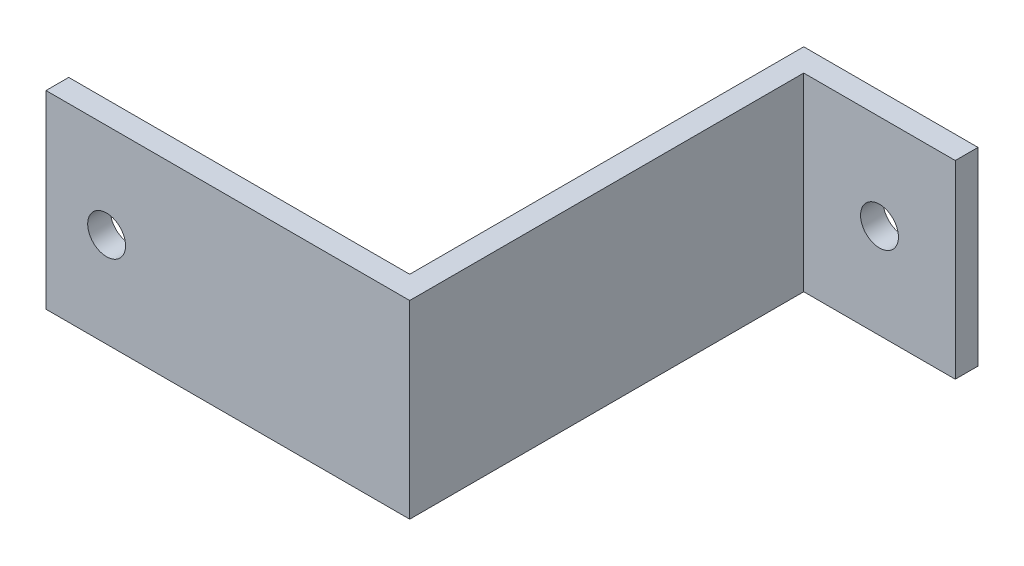
ISO-10303-21;
HEADER;
FILE_DESCRIPTION(('STEP AP214'),'2;1');
FILE_NAME('part.step','',(''),(''),'','','');
FILE_SCHEMA(('AUTOMOTIVE_DESIGN { 1 0 10303 214 1 1 1 1 }'));
ENDSEC;
DATA;
#1=APPLICATION_CONTEXT('core data for automotive mechanical design processes');
#2=APPLICATION_PROTOCOL_DEFINITION('international standard','automotive_design',2000,#1);
#3=PRODUCT_CONTEXT('',#1,'mechanical');
#4=PRODUCT('Part','Part','',(#3));
#5=PRODUCT_RELATED_PRODUCT_CATEGORY('part','',(#4));
#6=PRODUCT_DEFINITION_FORMATION('','',#4);
#7=PRODUCT_DEFINITION_CONTEXT('part definition',#1,'design');
#8=PRODUCT_DEFINITION('design','',#6,#7);
#9=PRODUCT_DEFINITION_SHAPE('','',#8);
#10=(LENGTH_UNIT() NAMED_UNIT(*) SI_UNIT(.MILLI.,.METRE.));
#11=(NAMED_UNIT(*) PLANE_ANGLE_UNIT() SI_UNIT($,.RADIAN.));
#12=(NAMED_UNIT(*) SI_UNIT($,.STERADIAN.) SOLID_ANGLE_UNIT());
#13=UNCERTAINTY_MEASURE_WITH_UNIT(LENGTH_MEASURE(1.E-05),#10,'distance_accuracy_value','');
#14=(GEOMETRIC_REPRESENTATION_CONTEXT(3) GLOBAL_UNCERTAINTY_ASSIGNED_CONTEXT((#13)) GLOBAL_UNIT_ASSIGNED_CONTEXT((#10,
#11,#12)) REPRESENTATION_CONTEXT('',''));
#15=CARTESIAN_POINT('',(0.,0.,0.));
#16=DIRECTION('',(0.,0.,1.));
#17=DIRECTION('',(1.,0.,0.));
#18=AXIS2_PLACEMENT_3D('',#15,#16,#17);
#19=CARTESIAN_POINT('',(-3.,25.,0.));
#20=DIRECTION('',(1.,0.,0.));
#21=DIRECTION('',(0.,0.,-1.));
#22=AXIS2_PLACEMENT_3D('',#19,#20,#21);
#23=PLANE('',#22);
#24=DIRECTION('',(0.,0.,1.));
#25=VECTOR('',#24,1.);
#26=CARTESIAN_POINT('',(-3.,0.,0.));
#27=LINE('',#26,#25);
#28=CARTESIAN_POINT('',(-3.,0.,0.));
#29=VERTEX_POINT('',#28);
#30=CARTESIAN_POINT('',(-2.99999999999999,0.,52.));
#31=VERTEX_POINT('',#30);
#32=EDGE_CURVE('E145',#29,#31,#27,.T.);
#33=ORIENTED_EDGE('',*,*,#32,.T.);
#34=DIRECTION('',(0.,-1.,0.));
#35=VECTOR('',#34,1.);
#36=CARTESIAN_POINT('',(-2.99999999999999,25.,52.));
#37=LINE('',#36,#35);
#38=CARTESIAN_POINT('',(-2.99999999999999,25.,52.));
#39=VERTEX_POINT('',#38);
#40=EDGE_CURVE('E49',#39,#31,#37,.T.);
#41=ORIENTED_EDGE('',*,*,#40,.F.);
#42=DIRECTION('',(0.,0.,1.));
#43=VECTOR('',#42,1.);
#44=CARTESIAN_POINT('',(-3.,25.,0.));
#45=LINE('',#44,#43);
#46=CARTESIAN_POINT('',(-3.,25.,0.));
#47=VERTEX_POINT('',#46);
#48=EDGE_CURVE('E101',#47,#39,#45,.T.);
#49=ORIENTED_EDGE('',*,*,#48,.F.);
#50=DIRECTION('',(0.,-1.,0.));
#51=VECTOR('',#50,1.);
#52=CARTESIAN_POINT('',(-3.,25.,0.));
#53=LINE('',#52,#51);
#54=EDGE_CURVE('E11',#47,#29,#53,.T.);
#55=ORIENTED_EDGE('',*,*,#54,.T.);
#56=EDGE_LOOP('',(#33,#41,#49,#55));
#57=FACE_BOUND('',#56,.T.);
#58=ADVANCED_FACE('F39',(#57),#23,.F.);
#59=CARTESIAN_POINT('',(-2.99999999999999,25.,52.));
#60=DIRECTION('',(0.,0.,1.));
#61=DIRECTION('',(1.,0.,0.));
#62=AXIS2_PLACEMENT_3D('',#59,#60,#61);
#63=PLANE('',#62);
#64=CARTESIAN_POINT('',(-40.,12.5,52.));
#65=DIRECTION('',(0.,0.,1.));
#66=DIRECTION('',(1.,0.,0.));
#67=AXIS2_PLACEMENT_3D('',#64,#65,#66);
#68=CIRCLE('',#67,2.5);
#69=CARTESIAN_POINT('',(-37.5,12.5,52.));
#70=VERTEX_POINT('',#69);
#71=EDGE_CURVE('E149',#70,#70,#68,.T.);
#72=ORIENTED_EDGE('',*,*,#71,.T.);
#73=EDGE_LOOP('',(#72));
#74=FACE_BOUND('',#73,.T.);
#75=DIRECTION('',(-1.,0.,0.));
#76=VECTOR('',#75,1.);
#77=CARTESIAN_POINT('',(-2.99999999999999,0.,52.));
#78=LINE('',#77,#76);
#79=CARTESIAN_POINT('',(-48.,0.,52.));
#80=VERTEX_POINT('',#79);
#81=EDGE_CURVE('E148',#31,#80,#78,.T.);
#82=ORIENTED_EDGE('',*,*,#81,.T.);
#83=DIRECTION('',(0.,-1.,0.));
#84=VECTOR('',#83,1.);
#85=CARTESIAN_POINT('',(-48.,25.,52.));
#86=LINE('',#85,#84);
#87=CARTESIAN_POINT('',(-48.,25.,52.));
#88=VERTEX_POINT('',#87);
#89=EDGE_CURVE('E178',#88,#80,#86,.T.);
#90=ORIENTED_EDGE('',*,*,#89,.F.);
#91=DIRECTION('',(-1.,0.,0.));
#92=VECTOR('',#91,1.);
#93=CARTESIAN_POINT('',(-2.99999999999999,25.,52.));
#94=LINE('',#93,#92);
#95=EDGE_CURVE('E189',#39,#88,#94,.T.);
#96=ORIENTED_EDGE('',*,*,#95,.F.);
#97=ORIENTED_EDGE('',*,*,#40,.T.);
#98=EDGE_LOOP('',(#82,#90,#96,#97));
#99=FACE_BOUND('',#98,.T.);
#100=ADVANCED_FACE('F187',(#74,#99),#63,.F.);
#101=CARTESIAN_POINT('',(-48.,25.,55.));
#102=DIRECTION('',(1.,0.,0.));
#103=DIRECTION('',(0.,0.,-1.));
#104=AXIS2_PLACEMENT_3D('',#101,#102,#103);
#105=PLANE('',#104);
#106=DIRECTION('',(0.,0.,1.));
#107=VECTOR('',#106,1.);
#108=CARTESIAN_POINT('',(-48.,0.,55.));
#109=LINE('',#108,#107);
#110=CARTESIAN_POINT('',(-48.,0.,55.));
#111=VERTEX_POINT('',#110);
#112=EDGE_CURVE('E152',#80,#111,#109,.T.);
#113=ORIENTED_EDGE('',*,*,#112,.T.);
#114=DIRECTION('',(0.,-1.,0.));
#115=VECTOR('',#114,1.);
#116=CARTESIAN_POINT('',(-48.,25.,55.));
#117=LINE('',#116,#115);
#118=CARTESIAN_POINT('',(-48.,25.,55.));
#119=VERTEX_POINT('',#118);
#120=EDGE_CURVE('E174',#119,#111,#117,.T.);
#121=ORIENTED_EDGE('',*,*,#120,.F.);
#122=DIRECTION('',(0.,0.,1.));
#123=VECTOR('',#122,1.);
#124=CARTESIAN_POINT('',(-48.,25.,55.));
#125=LINE('',#124,#123);
#126=EDGE_CURVE('E202',#88,#119,#125,.T.);
#127=ORIENTED_EDGE('',*,*,#126,.F.);
#128=ORIENTED_EDGE('',*,*,#89,.T.);
#129=EDGE_LOOP('',(#113,#121,#127,#128));
#130=FACE_BOUND('',#129,.T.);
#131=ADVANCED_FACE('F197',(#130),#105,.F.);
#132=CARTESIAN_POINT('',(0.,25.,55.));
#133=DIRECTION('',(0.,0.,-1.));
#134=DIRECTION('',(-1.,0.,0.));
#135=AXIS2_PLACEMENT_3D('',#132,#133,#134);
#136=PLANE('',#135);
#137=CARTESIAN_POINT('',(-40.,12.5,55.));
#138=DIRECTION('',(0.,0.,1.));
#139=DIRECTION('',(1.,0.,0.));
#140=AXIS2_PLACEMENT_3D('',#137,#138,#139);
#141=CIRCLE('',#140,2.5);
#142=CARTESIAN_POINT('',(-37.5,12.5,55.));
#143=VERTEX_POINT('',#142);
#144=EDGE_CURVE('E219',#143,#143,#141,.T.);
#145=ORIENTED_EDGE('',*,*,#144,.F.);
#146=EDGE_LOOP('',(#145));
#147=FACE_BOUND('',#146,.T.);
#148=DIRECTION('',(1.,0.,0.));
#149=VECTOR('',#148,1.);
#150=CARTESIAN_POINT('',(0.,0.,55.));
#151=LINE('',#150,#149);
#152=CARTESIAN_POINT('',(0.,0.,55.));
#153=VERTEX_POINT('',#152);
#154=EDGE_CURVE('E156',#111,#153,#151,.T.);
#155=ORIENTED_EDGE('',*,*,#154,.T.);
#156=DIRECTION('',(0.,-1.,0.));
#157=VECTOR('',#156,1.);
#158=CARTESIAN_POINT('',(0.,25.,55.));
#159=LINE('',#158,#157);
#160=CARTESIAN_POINT('',(0.,25.,55.));
#161=VERTEX_POINT('',#160);
#162=EDGE_CURVE('E132',#161,#153,#159,.T.);
#163=ORIENTED_EDGE('',*,*,#162,.F.);
#164=DIRECTION('',(1.,0.,0.));
#165=VECTOR('',#164,1.);
#166=CARTESIAN_POINT('',(-18.,25.,55.));
#167=LINE('',#166,#165);
#168=EDGE_CURVE('E121',#119,#161,#167,.T.);
#169=ORIENTED_EDGE('',*,*,#168,.F.);
#170=ORIENTED_EDGE('',*,*,#120,.T.);
#171=EDGE_LOOP('',(#155,#163,#169,#170));
#172=FACE_BOUND('',#171,.T.);
#173=ADVANCED_FACE('F200',(#147,#172),#136,.F.);
#174=CARTESIAN_POINT('',(0.,25.,3.));
#175=DIRECTION('',(-1.,0.,0.));
#176=DIRECTION('',(0.,0.,1.));
#177=AXIS2_PLACEMENT_3D('',#174,#175,#176);
#178=PLANE('',#177);
#179=DIRECTION('',(0.,0.,-1.));
#180=VECTOR('',#179,1.);
#181=CARTESIAN_POINT('',(0.,0.,3.));
#182=LINE('',#181,#180);
#183=CARTESIAN_POINT('',(0.,0.,3.));
#184=VERTEX_POINT('',#183);
#185=EDGE_CURVE('E130',#153,#184,#182,.T.);
#186=ORIENTED_EDGE('',*,*,#185,.T.);
#187=DIRECTION('',(0.,-1.,0.));
#188=VECTOR('',#187,1.);
#189=CARTESIAN_POINT('',(0.,25.,3.));
#190=LINE('',#189,#188);
#191=CARTESIAN_POINT('',(0.,25.,3.));
#192=VERTEX_POINT('',#191);
#193=EDGE_CURVE('E127',#192,#184,#190,.T.);
#194=ORIENTED_EDGE('',*,*,#193,.F.);
#195=DIRECTION('',(0.,0.,-1.));
#196=VECTOR('',#195,1.);
#197=CARTESIAN_POINT('',(0.,25.,3.));
#198=LINE('',#197,#196);
#199=EDGE_CURVE('E115',#161,#192,#198,.T.);
#200=ORIENTED_EDGE('',*,*,#199,.F.);
#201=ORIENTED_EDGE('',*,*,#162,.T.);
#202=EDGE_LOOP('',(#186,#194,#200,#201));
#203=FACE_BOUND('',#202,.T.);
#204=ADVANCED_FACE('F128',(#203),#178,.F.);
#205=CARTESIAN_POINT('',(0.,25.,3.));
#206=DIRECTION('',(0.,0.,-1.));
#207=DIRECTION('',(-1.,0.,0.));
#208=AXIS2_PLACEMENT_3D('',#205,#206,#207);
#209=PLANE('',#208);
#210=CARTESIAN_POINT('',(10.,12.5,3.));
#211=DIRECTION('',(0.,0.,-1.));
#212=DIRECTION('',(-1.,0.,0.));
#213=AXIS2_PLACEMENT_3D('',#210,#211,#212);
#214=CIRCLE('',#213,2.5);
#215=CARTESIAN_POINT('',(7.5,12.5,3.));
#216=VERTEX_POINT('',#215);
#217=EDGE_CURVE('E215',#216,#216,#214,.T.);
#218=ORIENTED_EDGE('',*,*,#217,.T.);
#219=EDGE_LOOP('',(#218));
#220=FACE_BOUND('',#219,.T.);
#221=DIRECTION('',(1.,0.,0.));
#222=VECTOR('',#221,1.);
#223=CARTESIAN_POINT('',(0.,0.,3.));
#224=LINE('',#223,#222);
#225=CARTESIAN_POINT('',(20.,0.,3.));
#226=VERTEX_POINT('',#225);
#227=EDGE_CURVE('E87',#184,#226,#224,.T.);
#228=ORIENTED_EDGE('',*,*,#227,.T.);
#229=DIRECTION('',(0.,-1.,0.));
#230=VECTOR('',#229,1.);
#231=CARTESIAN_POINT('',(20.,25.,3.));
#232=LINE('',#231,#230);
#233=CARTESIAN_POINT('',(20.,25.,3.));
#234=VERTEX_POINT('',#233);
#235=EDGE_CURVE('E133',#234,#226,#232,.T.);
#236=ORIENTED_EDGE('',*,*,#235,.F.);
#237=DIRECTION('',(1.,0.,0.));
#238=VECTOR('',#237,1.);
#239=CARTESIAN_POINT('',(0.,25.,3.));
#240=LINE('',#239,#238);
#241=EDGE_CURVE('E119',#192,#234,#240,.T.);
#242=ORIENTED_EDGE('',*,*,#241,.F.);
#243=ORIENTED_EDGE('',*,*,#193,.T.);
#244=EDGE_LOOP('',(#228,#236,#242,#243));
#245=FACE_BOUND('',#244,.T.);
#246=ADVANCED_FACE('F135',(#220,#245),#209,.F.);
#247=CARTESIAN_POINT('',(20.,25.,0.));
#248=DIRECTION('',(-1.,0.,0.));
#249=DIRECTION('',(0.,0.,1.));
#250=AXIS2_PLACEMENT_3D('',#247,#248,#249);
#251=PLANE('',#250);
#252=DIRECTION('',(0.,0.,-1.));
#253=VECTOR('',#252,1.);
#254=CARTESIAN_POINT('',(20.,0.,0.));
#255=LINE('',#254,#253);
#256=CARTESIAN_POINT('',(20.,0.,0.));
#257=VERTEX_POINT('',#256);
#258=EDGE_CURVE('E94',#226,#257,#255,.T.);
#259=ORIENTED_EDGE('',*,*,#258,.T.);
#260=DIRECTION('',(0.,-1.,0.));
#261=VECTOR('',#260,1.);
#262=CARTESIAN_POINT('',(20.,25.,0.));
#263=LINE('',#262,#261);
#264=CARTESIAN_POINT('',(20.,25.,0.));
#265=VERTEX_POINT('',#264);
#266=EDGE_CURVE('E141',#265,#257,#263,.T.);
#267=ORIENTED_EDGE('',*,*,#266,.F.);
#268=DIRECTION('',(0.,0.,-1.));
#269=VECTOR('',#268,1.);
#270=CARTESIAN_POINT('',(20.,25.,0.));
#271=LINE('',#270,#269);
#272=EDGE_CURVE('E138',#234,#265,#271,.T.);
#273=ORIENTED_EDGE('',*,*,#272,.F.);
#274=ORIENTED_EDGE('',*,*,#235,.T.);
#275=EDGE_LOOP('',(#259,#267,#273,#274));
#276=FACE_BOUND('',#275,.T.);
#277=ADVANCED_FACE('F238',(#276),#251,.F.);
#278=CARTESIAN_POINT('',(0.,25.,0.));
#279=DIRECTION('',(0.,0.,1.));
#280=DIRECTION('',(1.,0.,0.));
#281=AXIS2_PLACEMENT_3D('',#278,#279,#280);
#282=PLANE('',#281);
#283=CARTESIAN_POINT('',(10.,12.5,0.));
#284=DIRECTION('',(0.,0.,1.));
#285=DIRECTION('',(1.,0.,0.));
#286=AXIS2_PLACEMENT_3D('',#283,#284,#285);
#287=CIRCLE('',#286,2.5);
#288=CARTESIAN_POINT('',(12.5,12.5,0.));
#289=VERTEX_POINT('',#288);
#290=EDGE_CURVE('E42',#289,#289,#287,.T.);
#291=ORIENTED_EDGE('',*,*,#290,.T.);
#292=EDGE_LOOP('',(#291));
#293=FACE_BOUND('',#292,.T.);
#294=DIRECTION('',(-1.,0.,0.));
#295=VECTOR('',#294,1.);
#296=CARTESIAN_POINT('',(0.,0.,0.));
#297=LINE('',#296,#295);
#298=EDGE_CURVE('E165',#257,#29,#297,.T.);
#299=ORIENTED_EDGE('',*,*,#298,.T.);
#300=ORIENTED_EDGE('',*,*,#54,.F.);
#301=DIRECTION('',(-1.,0.,0.));
#302=VECTOR('',#301,1.);
#303=CARTESIAN_POINT('',(0.,25.,0.));
#304=LINE('',#303,#302);
#305=EDGE_CURVE('E57',#265,#47,#304,.T.);
#306=ORIENTED_EDGE('',*,*,#305,.F.);
#307=ORIENTED_EDGE('',*,*,#266,.T.);
#308=EDGE_LOOP('',(#299,#300,#306,#307));
#309=FACE_BOUND('',#308,.T.);
#310=ADVANCED_FACE('F228',(#293,#309),#282,.F.);
#311=CARTESIAN_POINT('',(0.,25.,0.));
#312=DIRECTION('',(0.,1.,0.));
#313=DIRECTION('',(0.,0.,1.));
#314=AXIS2_PLACEMENT_3D('',#311,#312,#313);
#315=PLANE('',#314);
#316=ORIENTED_EDGE('',*,*,#305,.T.);
#317=ORIENTED_EDGE('',*,*,#48,.T.);
#318=ORIENTED_EDGE('',*,*,#95,.T.);
#319=ORIENTED_EDGE('',*,*,#126,.T.);
#320=ORIENTED_EDGE('',*,*,#168,.T.);
#321=ORIENTED_EDGE('',*,*,#199,.T.);
#322=ORIENTED_EDGE('',*,*,#241,.T.);
#323=ORIENTED_EDGE('',*,*,#272,.T.);
#324=EDGE_LOOP('',(#316,#317,#318,#319,#320,#321,#322,#323));
#325=FACE_BOUND('',#324,.T.);
#326=ADVANCED_FACE('F117',(#325),#315,.T.);
#327=CARTESIAN_POINT('',(0.,0.,0.));
#328=DIRECTION('',(0.,1.,0.));
#329=DIRECTION('',(0.,0.,1.));
#330=AXIS2_PLACEMENT_3D('',#327,#328,#329);
#331=PLANE('',#330);
#332=ORIENTED_EDGE('',*,*,#32,.F.);
#333=ORIENTED_EDGE('',*,*,#298,.F.);
#334=ORIENTED_EDGE('',*,*,#258,.F.);
#335=ORIENTED_EDGE('',*,*,#227,.F.);
#336=ORIENTED_EDGE('',*,*,#185,.F.);
#337=ORIENTED_EDGE('',*,*,#154,.F.);
#338=ORIENTED_EDGE('',*,*,#112,.F.);
#339=ORIENTED_EDGE('',*,*,#81,.F.);
#340=EDGE_LOOP('',(#332,#333,#334,#335,#336,#337,#338,#339));
#341=FACE_BOUND('',#340,.T.);
#342=ADVANCED_FACE('F193',(#341),#331,.F.);
#343=CARTESIAN_POINT('',(10.,12.5,-13.));
#344=DIRECTION('',(0.,0.,1.));
#345=DIRECTION('',(1.,0.,0.));
#346=AXIS2_PLACEMENT_3D('',#343,#344,#345);
#347=CYLINDRICAL_SURFACE('',#346,2.5);
#348=ORIENTED_EDGE('',*,*,#290,.F.);
#349=EDGE_LOOP('',(#348));
#350=FACE_BOUND('',#349,.T.);
#351=ORIENTED_EDGE('',*,*,#217,.F.);
#352=EDGE_LOOP('',(#351));
#353=FACE_BOUND('',#352,.T.);
#354=ADVANCED_FACE('F230',(#350,#353),#347,.F.);
#355=CARTESIAN_POINT('',(-40.,12.5,-13.));
#356=DIRECTION('',(0.,0.,1.));
#357=DIRECTION('',(1.,0.,0.));
#358=AXIS2_PLACEMENT_3D('',#355,#356,#357);
#359=CYLINDRICAL_SURFACE('',#358,2.5);
#360=ORIENTED_EDGE('',*,*,#144,.T.);
#361=EDGE_LOOP('',(#360));
#362=FACE_BOUND('',#361,.T.);
#363=ORIENTED_EDGE('',*,*,#71,.F.);
#364=EDGE_LOOP('',(#363));
#365=FACE_BOUND('',#364,.T.);
#366=ADVANCED_FACE('F233',(#362,#365),#359,.F.);
#367=CLOSED_SHELL('',(#58,#100,#131,#173,#204,#246,#277,#310,#326,#342,#354,#366));
#368=MANIFOLD_SOLID_BREP('B2',#367);
#369=ADVANCED_BREP_SHAPE_REPRESENTATION('',(#18,#368),#14);
#370=SHAPE_DEFINITION_REPRESENTATION(#9,#369);
ENDSEC;
END-ISO-10303-21;
